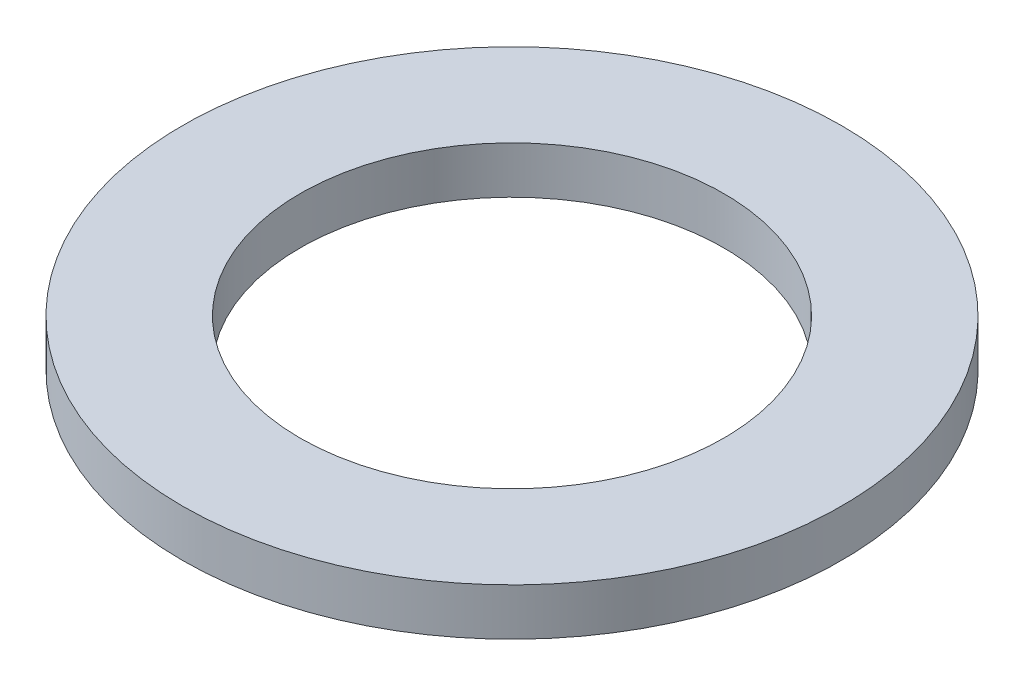
ISO-10303-21;
HEADER;
FILE_DESCRIPTION(('STEP AP214'),'2;1');
FILE_NAME('part.step','',(''),(''),'','','');
FILE_SCHEMA(('AUTOMOTIVE_DESIGN { 1 0 10303 214 1 1 1 1 }'));
ENDSEC;
DATA;
#1=APPLICATION_CONTEXT('core data for automotive mechanical design processes');
#2=APPLICATION_PROTOCOL_DEFINITION('international standard','automotive_design',2000,#1);
#3=PRODUCT_CONTEXT('',#1,'mechanical');
#4=PRODUCT('Part','Part','',(#3));
#5=PRODUCT_RELATED_PRODUCT_CATEGORY('part','',(#4));
#6=PRODUCT_DEFINITION_FORMATION('','',#4);
#7=PRODUCT_DEFINITION_CONTEXT('part definition',#1,'design');
#8=PRODUCT_DEFINITION('design','',#6,#7);
#9=PRODUCT_DEFINITION_SHAPE('','',#8);
#10=(LENGTH_UNIT() NAMED_UNIT(*) SI_UNIT(.MILLI.,.METRE.));
#11=(NAMED_UNIT(*) PLANE_ANGLE_UNIT() SI_UNIT($,.RADIAN.));
#12=(NAMED_UNIT(*) SI_UNIT($,.STERADIAN.) SOLID_ANGLE_UNIT());
#13=UNCERTAINTY_MEASURE_WITH_UNIT(LENGTH_MEASURE(1.E-05),#10,'distance_accuracy_value','');
#14=(GEOMETRIC_REPRESENTATION_CONTEXT(3) GLOBAL_UNCERTAINTY_ASSIGNED_CONTEXT((#13)) GLOBAL_UNIT_ASSIGNED_CONTEXT((#10,
#11,#12)) REPRESENTATION_CONTEXT('',''));
#15=CARTESIAN_POINT('',(0.,0.,0.));
#16=DIRECTION('',(0.,0.,1.));
#17=DIRECTION('',(1.,0.,0.));
#18=AXIS2_PLACEMENT_3D('',#15,#16,#17);
#19=CARTESIAN_POINT('',(0.,10.,0.));
#20=DIRECTION('',(0.,-1.,0.));
#21=DIRECTION('',(0.,0.,-1.));
#22=AXIS2_PLACEMENT_3D('',#19,#20,#21);
#23=CYLINDRICAL_SURFACE('',#22,70.);
#24=CARTESIAN_POINT('',(0.,10.,0.));
#25=DIRECTION('',(0.,1.,0.));
#26=DIRECTION('',(0.,0.,1.));
#27=AXIS2_PLACEMENT_3D('',#24,#25,#26);
#28=CIRCLE('',#27,70.);
#29=CARTESIAN_POINT('',(0.,10.,70.));
#30=VERTEX_POINT('',#29);
#31=EDGE_CURVE('E10',#30,#30,#28,.T.);
#32=ORIENTED_EDGE('',*,*,#31,.F.);
#33=EDGE_LOOP('',(#32));
#34=FACE_BOUND('',#33,.T.);
#35=CARTESIAN_POINT('',(0.,0.,0.));
#36=DIRECTION('',(0.,1.,0.));
#37=DIRECTION('',(0.,0.,1.));
#38=AXIS2_PLACEMENT_3D('',#35,#36,#37);
#39=CIRCLE('',#38,70.);
#40=CARTESIAN_POINT('',(0.,0.,70.));
#41=VERTEX_POINT('',#40);
#42=EDGE_CURVE('E37',#41,#41,#39,.T.);
#43=ORIENTED_EDGE('',*,*,#42,.T.);
#44=EDGE_LOOP('',(#43));
#45=FACE_BOUND('',#44,.T.);
#46=ADVANCED_FACE('F40',(#34,#45),#23,.T.);
#47=CARTESIAN_POINT('',(0.,10.,0.));
#48=DIRECTION('',(0.,1.,0.));
#49=DIRECTION('',(0.,0.,1.));
#50=AXIS2_PLACEMENT_3D('',#47,#48,#49);
#51=PLANE('',#50);
#52=CARTESIAN_POINT('',(0.,10.,0.));
#53=DIRECTION('',(0.,1.,0.));
#54=DIRECTION('',(0.,0.,1.));
#55=AXIS2_PLACEMENT_3D('',#52,#53,#54);
#56=CIRCLE('',#55,45.);
#57=CARTESIAN_POINT('',(0.,10.,45.));
#58=VERTEX_POINT('',#57);
#59=EDGE_CURVE('E50',#58,#58,#56,.T.);
#60=ORIENTED_EDGE('',*,*,#59,.F.);
#61=EDGE_LOOP('',(#60));
#62=FACE_BOUND('',#61,.T.);
#63=ORIENTED_EDGE('',*,*,#31,.T.);
#64=EDGE_LOOP('',(#63));
#65=FACE_BOUND('',#64,.T.);
#66=ADVANCED_FACE('F59',(#62,#65),#51,.T.);
#67=CARTESIAN_POINT('',(0.,0.,0.));
#68=DIRECTION('',(0.,1.,0.));
#69=DIRECTION('',(0.,0.,1.));
#70=AXIS2_PLACEMENT_3D('',#67,#68,#69);
#71=PLANE('',#70);
#72=CARTESIAN_POINT('',(0.,0.,0.));
#73=DIRECTION('',(0.,1.,0.));
#74=DIRECTION('',(0.,0.,1.));
#75=AXIS2_PLACEMENT_3D('',#72,#73,#74);
#76=CIRCLE('',#75,45.);
#77=CARTESIAN_POINT('',(0.,0.,45.));
#78=VERTEX_POINT('',#77);
#79=EDGE_CURVE('E47',#78,#78,#76,.T.);
#80=ORIENTED_EDGE('',*,*,#79,.T.);
#81=EDGE_LOOP('',(#80));
#82=FACE_BOUND('',#81,.T.);
#83=ORIENTED_EDGE('',*,*,#42,.F.);
#84=EDGE_LOOP('',(#83));
#85=FACE_BOUND('',#84,.T.);
#86=ADVANCED_FACE('F58',(#82,#85),#71,.F.);
#87=CARTESIAN_POINT('',(0.,10.,0.));
#88=DIRECTION('',(0.,-1.,0.));
#89=DIRECTION('',(0.,0.,-1.));
#90=AXIS2_PLACEMENT_3D('',#87,#88,#89);
#91=CYLINDRICAL_SURFACE('',#90,45.);
#92=ORIENTED_EDGE('',*,*,#59,.T.);
#93=EDGE_LOOP('',(#92));
#94=FACE_BOUND('',#93,.T.);
#95=ORIENTED_EDGE('',*,*,#79,.F.);
#96=EDGE_LOOP('',(#95));
#97=FACE_BOUND('',#96,.T.);
#98=ADVANCED_FACE('F54',(#94,#97),#91,.F.);
#99=CLOSED_SHELL('',(#46,#66,#86,#98));
#100=MANIFOLD_SOLID_BREP('B2',#99);
#101=ADVANCED_BREP_SHAPE_REPRESENTATION('',(#18,#100),#14);
#102=SHAPE_DEFINITION_REPRESENTATION(#9,#101);
ENDSEC;
END-ISO-10303-21;
